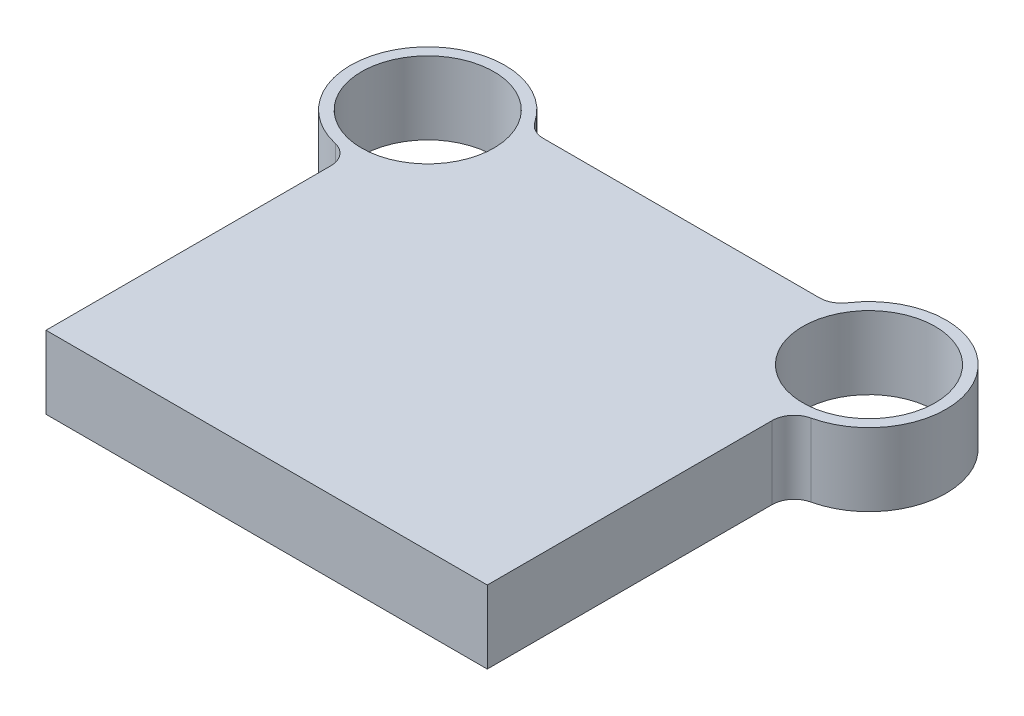
ISO-10303-21;
HEADER;
FILE_DESCRIPTION(('STEP AP214'),'2;1');
FILE_NAME('part.step','',(''),(''),'','','');
FILE_SCHEMA(('AUTOMOTIVE_DESIGN { 1 0 10303 214 1 1 1 1 }'));
ENDSEC;
DATA;
#1=APPLICATION_CONTEXT('core data for automotive mechanical design processes');
#2=APPLICATION_PROTOCOL_DEFINITION('international standard','automotive_design',2000,#1);
#3=PRODUCT_CONTEXT('',#1,'mechanical');
#4=PRODUCT('Part','Part','',(#3));
#5=PRODUCT_RELATED_PRODUCT_CATEGORY('part','',(#4));
#6=PRODUCT_DEFINITION_FORMATION('','',#4);
#7=PRODUCT_DEFINITION_CONTEXT('part definition',#1,'design');
#8=PRODUCT_DEFINITION('design','',#6,#7);
#9=PRODUCT_DEFINITION_SHAPE('','',#8);
#10=(LENGTH_UNIT() NAMED_UNIT(*) SI_UNIT(.MILLI.,.METRE.));
#11=(NAMED_UNIT(*) PLANE_ANGLE_UNIT() SI_UNIT($,.RADIAN.));
#12=(NAMED_UNIT(*) SI_UNIT($,.STERADIAN.) SOLID_ANGLE_UNIT());
#13=UNCERTAINTY_MEASURE_WITH_UNIT(LENGTH_MEASURE(1.E-05),#10,'distance_accuracy_value','');
#14=(GEOMETRIC_REPRESENTATION_CONTEXT(3) GLOBAL_UNCERTAINTY_ASSIGNED_CONTEXT((#13)) GLOBAL_UNIT_ASSIGNED_CONTEXT((#10,
#11,#12)) REPRESENTATION_CONTEXT('',''));
#15=CARTESIAN_POINT('',(0.,0.,0.));
#16=DIRECTION('',(0.,0.,1.));
#17=DIRECTION('',(1.,0.,0.));
#18=AXIS2_PLACEMENT_3D('',#15,#16,#17);
#19=CARTESIAN_POINT('',(-100.,33.,-173.));
#20=DIRECTION('',(0.,1.,0.));
#21=DIRECTION('',(0.,0.,1.));
#22=AXIS2_PLACEMENT_3D('',#19,#20,#21);
#23=PLANE('',#22);
#24=CARTESIAN_POINT('',(-100.,33.,-173.));
#25=DIRECTION('',(0.,1.,0.));
#26=DIRECTION('',(0.,0.,1.));
#27=AXIS2_PLACEMENT_3D('',#24,#25,#26);
#28=CIRCLE('',#27,30.);
#29=CARTESIAN_POINT('',(-100.,33.,-143.));
#30=VERTEX_POINT('',#29);
#31=EDGE_CURVE('E240',#30,#30,#28,.T.);
#32=ORIENTED_EDGE('',*,*,#31,.F.);
#33=EDGE_LOOP('',(#32));
#34=FACE_BOUND('',#33,.T.);
#35=CARTESIAN_POINT('',(-100.,33.,-173.));
#36=DIRECTION('',(0.,1.,0.));
#37=DIRECTION('',(0.,0.,1.));
#38=AXIS2_PLACEMENT_3D('',#35,#36,#37);
#39=CIRCLE('',#38,35.);
#40=CARTESIAN_POINT('',(-70.8982203250916,33.,-192.444444444444));
#41=VERTEX_POINT('',#40);
#42=CARTESIAN_POINT('',(-107.777777777778,33.,-138.875138493475));
#43=VERTEX_POINT('',#42);
#44=EDGE_CURVE('E133',#41,#43,#39,.T.);
#45=ORIENTED_EDGE('',*,*,#44,.T.);
#46=CARTESIAN_POINT('',(-110.,33.,-129.125178063039));
#47=DIRECTION('',(0.,1.,0.));
#48=DIRECTION('',(0.,0.,1.));
#49=AXIS2_PLACEMENT_3D('',#46,#47,#48);
#50=CIRCLE('',#49,10.);
#51=CARTESIAN_POINT('',(-100.,33.,-129.125178063039));
#52=VERTEX_POINT('',#51);
#53=EDGE_CURVE('E11',#43,#52,#50,.F.);
#54=ORIENTED_EDGE('',*,*,#53,.T.);
#55=DIRECTION('',(0.,0.,1.));
#56=VECTOR('',#55,1.);
#57=CARTESIAN_POINT('',(-100.,33.,0.));
#58=LINE('',#57,#56);
#59=CARTESIAN_POINT('',(-100.,33.,0.));
#60=VERTEX_POINT('',#59);
#61=EDGE_CURVE('E106',#52,#60,#58,.T.);
#62=ORIENTED_EDGE('',*,*,#61,.T.);
#63=DIRECTION('',(1.,0.,0.));
#64=VECTOR('',#63,1.);
#65=CARTESIAN_POINT('',(100.,33.,0.));
#66=LINE('',#65,#64);
#67=CARTESIAN_POINT('',(100.,33.,0.));
#68=VERTEX_POINT('',#67);
#69=EDGE_CURVE('E110',#60,#68,#66,.T.);
#70=ORIENTED_EDGE('',*,*,#69,.T.);
#71=DIRECTION('',(0.,0.,-1.));
#72=VECTOR('',#71,1.);
#73=CARTESIAN_POINT('',(100.,33.,0.));
#74=LINE('',#73,#72);
#75=CARTESIAN_POINT('',(100.,33.,-129.125178063039));
#76=VERTEX_POINT('',#75);
#77=EDGE_CURVE('E123',#68,#76,#74,.T.);
#78=ORIENTED_EDGE('',*,*,#77,.T.);
#79=CARTESIAN_POINT('',(110.,33.,-129.125178063039));
#80=DIRECTION('',(0.,1.,0.));
#81=DIRECTION('',(0.,0.,1.));
#82=AXIS2_PLACEMENT_3D('',#79,#80,#81);
#83=CIRCLE('',#82,10.);
#84=CARTESIAN_POINT('',(107.777777777778,33.,-138.875138493475));
#85=VERTEX_POINT('',#84);
#86=EDGE_CURVE('E155',#76,#85,#83,.F.);
#87=ORIENTED_EDGE('',*,*,#86,.T.);
#88=CARTESIAN_POINT('',(100.,33.,-173.));
#89=DIRECTION('',(0.,1.,0.));
#90=DIRECTION('',(0.,0.,-1.));
#91=AXIS2_PLACEMENT_3D('',#88,#89,#90);
#92=CIRCLE('',#91,35.);
#93=CARTESIAN_POINT('',(70.8982203250916,33.,-192.444444444444));
#94=VERTEX_POINT('',#93);
#95=EDGE_CURVE('E229',#85,#94,#92,.T.);
#96=ORIENTED_EDGE('',*,*,#95,.T.);
#97=CARTESIAN_POINT('',(62.5834261322606,33.,-198.));
#98=DIRECTION('',(0.,1.,0.));
#99=DIRECTION('',(0.,0.,1.));
#100=AXIS2_PLACEMENT_3D('',#97,#98,#99);
#101=CIRCLE('',#100,10.);
#102=CARTESIAN_POINT('',(62.5834261322606,33.,-188.));
#103=VERTEX_POINT('',#102);
#104=EDGE_CURVE('E159',#94,#103,#101,.F.);
#105=ORIENTED_EDGE('',*,*,#104,.T.);
#106=DIRECTION('',(-1.,0.,0.));
#107=VECTOR('',#106,1.);
#108=CARTESIAN_POINT('',(68.3772233983162,33.,-188.));
#109=LINE('',#108,#107);
#110=CARTESIAN_POINT('',(-62.5834261322606,33.,-188.));
#111=VERTEX_POINT('',#110);
#112=EDGE_CURVE('E226',#103,#111,#109,.T.);
#113=ORIENTED_EDGE('',*,*,#112,.T.);
#114=CARTESIAN_POINT('',(-62.5834261322606,33.,-198.));
#115=DIRECTION('',(0.,1.,0.));
#116=DIRECTION('',(0.,0.,1.));
#117=AXIS2_PLACEMENT_3D('',#114,#115,#116);
#118=CIRCLE('',#117,10.);
#119=EDGE_CURVE('E163',#111,#41,#118,.F.);
#120=ORIENTED_EDGE('',*,*,#119,.T.);
#121=EDGE_LOOP('',(#45,#54,#62,#70,#78,#87,#96,#105,#113,#120));
#122=FACE_BOUND('',#121,.T.);
#123=CARTESIAN_POINT('',(100.,33.,-173.));
#124=DIRECTION('',(0.,1.,0.));
#125=DIRECTION('',(0.,0.,-1.));
#126=AXIS2_PLACEMENT_3D('',#123,#124,#125);
#127=CIRCLE('',#126,30.);
#128=CARTESIAN_POINT('',(100.,33.,-203.));
#129=VERTEX_POINT('',#128);
#130=EDGE_CURVE('E257',#129,#129,#127,.T.);
#131=ORIENTED_EDGE('',*,*,#130,.F.);
#132=EDGE_LOOP('',(#131));
#133=FACE_BOUND('',#132,.T.);
#134=ADVANCED_FACE('F33',(#34,#122,#133),#23,.T.);
#135=CARTESIAN_POINT('',(-100.,0.,-173.));
#136=DIRECTION('',(0.,1.,0.));
#137=DIRECTION('',(0.,0.,1.));
#138=AXIS2_PLACEMENT_3D('',#135,#136,#137);
#139=PLANE('',#138);
#140=DIRECTION('',(0.,0.,1.));
#141=VECTOR('',#140,1.);
#142=CARTESIAN_POINT('',(-100.,0.,0.));
#143=LINE('',#142,#141);
#144=CARTESIAN_POINT('',(-100.,0.,-129.125178063039));
#145=VERTEX_POINT('',#144);
#146=CARTESIAN_POINT('',(-100.,0.,0.));
#147=VERTEX_POINT('',#146);
#148=EDGE_CURVE('E127',#145,#147,#143,.T.);
#149=ORIENTED_EDGE('',*,*,#148,.F.);
#150=CARTESIAN_POINT('',(-110.,0.,-129.125178063039));
#151=DIRECTION('',(0.,1.,0.));
#152=DIRECTION('',(0.,0.,1.));
#153=AXIS2_PLACEMENT_3D('',#150,#151,#152);
#154=CIRCLE('',#153,10.);
#155=CARTESIAN_POINT('',(-107.777777777778,0.,-138.875138493475));
#156=VERTEX_POINT('',#155);
#157=EDGE_CURVE('E41',#145,#156,#154,.T.);
#158=ORIENTED_EDGE('',*,*,#157,.T.);
#159=CARTESIAN_POINT('',(-100.,0.,-173.));
#160=DIRECTION('',(0.,1.,0.));
#161=DIRECTION('',(0.,0.,1.));
#162=AXIS2_PLACEMENT_3D('',#159,#160,#161);
#163=CIRCLE('',#162,35.);
#164=CARTESIAN_POINT('',(-70.8982203250916,0.,-192.444444444444));
#165=VERTEX_POINT('',#164);
#166=EDGE_CURVE('E114',#165,#156,#163,.T.);
#167=ORIENTED_EDGE('',*,*,#166,.F.);
#168=CARTESIAN_POINT('',(-62.5834261322606,0.,-198.));
#169=DIRECTION('',(0.,1.,0.));
#170=DIRECTION('',(0.,0.,1.));
#171=AXIS2_PLACEMENT_3D('',#168,#169,#170);
#172=CIRCLE('',#171,10.);
#173=CARTESIAN_POINT('',(-62.5834261322606,0.,-188.));
#174=VERTEX_POINT('',#173);
#175=EDGE_CURVE('E161',#165,#174,#172,.T.);
#176=ORIENTED_EDGE('',*,*,#175,.T.);
#177=DIRECTION('',(-1.,0.,0.));
#178=VECTOR('',#177,1.);
#179=CARTESIAN_POINT('',(68.3772233983162,0.,-188.));
#180=LINE('',#179,#178);
#181=CARTESIAN_POINT('',(62.5834261322606,0.,-188.));
#182=VERTEX_POINT('',#181);
#183=EDGE_CURVE('E173',#182,#174,#180,.T.);
#184=ORIENTED_EDGE('',*,*,#183,.F.);
#185=CARTESIAN_POINT('',(62.5834261322606,0.,-198.));
#186=DIRECTION('',(0.,1.,0.));
#187=DIRECTION('',(0.,0.,1.));
#188=AXIS2_PLACEMENT_3D('',#185,#186,#187);
#189=CIRCLE('',#188,10.);
#190=CARTESIAN_POINT('',(70.8982203250916,0.,-192.444444444444));
#191=VERTEX_POINT('',#190);
#192=EDGE_CURVE('E157',#182,#191,#189,.T.);
#193=ORIENTED_EDGE('',*,*,#192,.T.);
#194=CARTESIAN_POINT('',(100.,0.,-173.));
#195=DIRECTION('',(0.,1.,0.));
#196=DIRECTION('',(0.,0.,-1.));
#197=AXIS2_PLACEMENT_3D('',#194,#195,#196);
#198=CIRCLE('',#197,35.);
#199=CARTESIAN_POINT('',(107.777777777778,0.,-138.875138493475));
#200=VERTEX_POINT('',#199);
#201=EDGE_CURVE('E245',#200,#191,#198,.T.);
#202=ORIENTED_EDGE('',*,*,#201,.F.);
#203=CARTESIAN_POINT('',(110.,0.,-129.125178063039));
#204=DIRECTION('',(0.,1.,0.));
#205=DIRECTION('',(0.,0.,1.));
#206=AXIS2_PLACEMENT_3D('',#203,#204,#205);
#207=CIRCLE('',#206,10.);
#208=CARTESIAN_POINT('',(100.,0.,-129.125178063039));
#209=VERTEX_POINT('',#208);
#210=EDGE_CURVE('E153',#200,#209,#207,.T.);
#211=ORIENTED_EDGE('',*,*,#210,.T.);
#212=DIRECTION('',(0.,0.,-1.));
#213=VECTOR('',#212,1.);
#214=CARTESIAN_POINT('',(100.,0.,0.));
#215=LINE('',#214,#213);
#216=CARTESIAN_POINT('',(100.,0.,0.));
#217=VERTEX_POINT('',#216);
#218=EDGE_CURVE('E242',#217,#209,#215,.T.);
#219=ORIENTED_EDGE('',*,*,#218,.F.);
#220=DIRECTION('',(1.,0.,0.));
#221=VECTOR('',#220,1.);
#222=CARTESIAN_POINT('',(100.,0.,0.));
#223=LINE('',#222,#221);
#224=EDGE_CURVE('E239',#147,#217,#223,.T.);
#225=ORIENTED_EDGE('',*,*,#224,.F.);
#226=EDGE_LOOP('',(#149,#158,#167,#176,#184,#193,#202,#211,#219,#225));
#227=FACE_BOUND('',#226,.T.);
#228=CARTESIAN_POINT('',(-100.,0.,-173.));
#229=DIRECTION('',(0.,1.,0.));
#230=DIRECTION('',(0.,0.,1.));
#231=AXIS2_PLACEMENT_3D('',#228,#229,#230);
#232=CIRCLE('',#231,30.);
#233=CARTESIAN_POINT('',(-100.,0.,-143.));
#234=VERTEX_POINT('',#233);
#235=EDGE_CURVE('E254',#234,#234,#232,.T.);
#236=ORIENTED_EDGE('',*,*,#235,.T.);
#237=EDGE_LOOP('',(#236));
#238=FACE_BOUND('',#237,.T.);
#239=CARTESIAN_POINT('',(100.,0.,-173.));
#240=DIRECTION('',(0.,1.,0.));
#241=DIRECTION('',(0.,0.,-1.));
#242=AXIS2_PLACEMENT_3D('',#239,#240,#241);
#243=CIRCLE('',#242,30.);
#244=CARTESIAN_POINT('',(100.,0.,-203.));
#245=VERTEX_POINT('',#244);
#246=EDGE_CURVE('E260',#245,#245,#243,.T.);
#247=ORIENTED_EDGE('',*,*,#246,.T.);
#248=EDGE_LOOP('',(#247));
#249=FACE_BOUND('',#248,.T.);
#250=ADVANCED_FACE('F167',(#227,#238,#249),#139,.F.);
#251=CARTESIAN_POINT('',(-100.,33.,0.));
#252=DIRECTION('',(1.,0.,0.));
#253=DIRECTION('',(0.,0.,-1.));
#254=AXIS2_PLACEMENT_3D('',#251,#252,#253);
#255=PLANE('',#254);
#256=ORIENTED_EDGE('',*,*,#61,.F.);
#257=DIRECTION('',(0.,1.,0.));
#258=VECTOR('',#257,1.);
#259=CARTESIAN_POINT('',(-100.,0.,-129.125178063039));
#260=LINE('',#259,#258);
#261=EDGE_CURVE('E151',#52,#145,#260,.F.);
#262=ORIENTED_EDGE('',*,*,#261,.T.);
#263=ORIENTED_EDGE('',*,*,#148,.T.);
#264=DIRECTION('',(0.,-1.,0.));
#265=VECTOR('',#264,1.);
#266=CARTESIAN_POINT('',(-100.,33.,0.));
#267=LINE('',#266,#265);
#268=EDGE_CURVE('E119',#60,#147,#267,.T.);
#269=ORIENTED_EDGE('',*,*,#268,.F.);
#270=EDGE_LOOP('',(#256,#262,#263,#269));
#271=FACE_BOUND('',#270,.T.);
#272=ADVANCED_FACE('F125',(#271),#255,.F.);
#273=CARTESIAN_POINT('',(100.,33.,0.));
#274=DIRECTION('',(0.,0.,-1.));
#275=DIRECTION('',(-1.,0.,0.));
#276=AXIS2_PLACEMENT_3D('',#273,#274,#275);
#277=PLANE('',#276);
#278=ORIENTED_EDGE('',*,*,#224,.T.);
#279=DIRECTION('',(0.,-1.,0.));
#280=VECTOR('',#279,1.);
#281=CARTESIAN_POINT('',(100.,33.,0.));
#282=LINE('',#281,#280);
#283=EDGE_CURVE('E121',#68,#217,#282,.T.);
#284=ORIENTED_EDGE('',*,*,#283,.F.);
#285=ORIENTED_EDGE('',*,*,#69,.F.);
#286=ORIENTED_EDGE('',*,*,#268,.T.);
#287=EDGE_LOOP('',(#278,#284,#285,#286));
#288=FACE_BOUND('',#287,.T.);
#289=ADVANCED_FACE('F118',(#288),#277,.F.);
#290=CARTESIAN_POINT('',(100.,33.,0.));
#291=DIRECTION('',(-1.,0.,0.));
#292=DIRECTION('',(0.,0.,1.));
#293=AXIS2_PLACEMENT_3D('',#290,#291,#292);
#294=PLANE('',#293);
#295=ORIENTED_EDGE('',*,*,#218,.T.);
#296=DIRECTION('',(0.,1.,0.));
#297=VECTOR('',#296,1.);
#298=CARTESIAN_POINT('',(100.,33.,-129.125178063039));
#299=LINE('',#298,#297);
#300=EDGE_CURVE('E139',#209,#76,#299,.T.);
#301=ORIENTED_EDGE('',*,*,#300,.T.);
#302=ORIENTED_EDGE('',*,*,#77,.F.);
#303=ORIENTED_EDGE('',*,*,#283,.T.);
#304=EDGE_LOOP('',(#295,#301,#302,#303));
#305=FACE_BOUND('',#304,.T.);
#306=ADVANCED_FACE('F202',(#305),#294,.F.);
#307=CARTESIAN_POINT('',(100.,33.,-173.));
#308=DIRECTION('',(0.,-1.,0.));
#309=DIRECTION('',(0.,0.,-1.));
#310=AXIS2_PLACEMENT_3D('',#307,#308,#309);
#311=CYLINDRICAL_SURFACE('',#310,35.);
#312=ORIENTED_EDGE('',*,*,#95,.F.);
#313=DIRECTION('',(0.,-1.,0.));
#314=VECTOR('',#313,1.);
#315=CARTESIAN_POINT('',(107.777777777778,33.,-138.875138493475));
#316=LINE('',#315,#314);
#317=EDGE_CURVE('E131',#85,#200,#316,.T.);
#318=ORIENTED_EDGE('',*,*,#317,.T.);
#319=ORIENTED_EDGE('',*,*,#201,.T.);
#320=DIRECTION('',(0.,-1.,0.));
#321=VECTOR('',#320,1.);
#322=CARTESIAN_POINT('',(70.8982203250916,33.,-192.444444444444));
#323=LINE('',#322,#321);
#324=EDGE_CURVE('E129',#191,#94,#323,.F.);
#325=ORIENTED_EDGE('',*,*,#324,.T.);
#326=EDGE_LOOP('',(#312,#318,#319,#325));
#327=FACE_BOUND('',#326,.T.);
#328=ADVANCED_FACE('F198',(#327),#311,.T.);
#329=CARTESIAN_POINT('',(68.3772233983162,33.,-188.));
#330=DIRECTION('',(0.,0.,1.));
#331=DIRECTION('',(1.,0.,0.));
#332=AXIS2_PLACEMENT_3D('',#329,#330,#331);
#333=PLANE('',#332);
#334=ORIENTED_EDGE('',*,*,#112,.F.);
#335=DIRECTION('',(0.,1.,0.));
#336=VECTOR('',#335,1.);
#337=CARTESIAN_POINT('',(62.5834261322606,0.,-188.));
#338=LINE('',#337,#336);
#339=EDGE_CURVE('E143',#103,#182,#338,.F.);
#340=ORIENTED_EDGE('',*,*,#339,.T.);
#341=ORIENTED_EDGE('',*,*,#183,.T.);
#342=DIRECTION('',(0.,1.,0.));
#343=VECTOR('',#342,1.);
#344=CARTESIAN_POINT('',(-62.5834261322606,33.,-188.));
#345=LINE('',#344,#343);
#346=EDGE_CURVE('E141',#174,#111,#345,.T.);
#347=ORIENTED_EDGE('',*,*,#346,.T.);
#348=EDGE_LOOP('',(#334,#340,#341,#347));
#349=FACE_BOUND('',#348,.T.);
#350=ADVANCED_FACE('F195',(#349),#333,.F.);
#351=CARTESIAN_POINT('',(-100.,33.,-173.));
#352=DIRECTION('',(0.,-1.,0.));
#353=DIRECTION('',(0.,0.,-1.));
#354=AXIS2_PLACEMENT_3D('',#351,#352,#353);
#355=CYLINDRICAL_SURFACE('',#354,35.);
#356=ORIENTED_EDGE('',*,*,#44,.F.);
#357=DIRECTION('',(0.,-1.,0.));
#358=VECTOR('',#357,1.);
#359=CARTESIAN_POINT('',(-70.8982203250916,33.,-192.444444444444));
#360=LINE('',#359,#358);
#361=EDGE_CURVE('E148',#41,#165,#360,.T.);
#362=ORIENTED_EDGE('',*,*,#361,.T.);
#363=ORIENTED_EDGE('',*,*,#166,.T.);
#364=DIRECTION('',(0.,-1.,0.));
#365=VECTOR('',#364,1.);
#366=CARTESIAN_POINT('',(-107.777777777778,33.,-138.875138493475));
#367=LINE('',#366,#365);
#368=EDGE_CURVE('E146',#156,#43,#367,.F.);
#369=ORIENTED_EDGE('',*,*,#368,.T.);
#370=EDGE_LOOP('',(#356,#362,#363,#369));
#371=FACE_BOUND('',#370,.T.);
#372=ADVANCED_FACE('F171',(#371),#355,.T.);
#373=CARTESIAN_POINT('',(-100.,33.,-173.));
#374=DIRECTION('',(0.,-1.,0.));
#375=DIRECTION('',(0.,0.,-1.));
#376=AXIS2_PLACEMENT_3D('',#373,#374,#375);
#377=CYLINDRICAL_SURFACE('',#376,30.);
#378=ORIENTED_EDGE('',*,*,#31,.T.);
#379=EDGE_LOOP('',(#378));
#380=FACE_BOUND('',#379,.T.);
#381=ORIENTED_EDGE('',*,*,#235,.F.);
#382=EDGE_LOOP('',(#381));
#383=FACE_BOUND('',#382,.T.);
#384=ADVANCED_FACE('F190',(#380,#383),#377,.F.);
#385=CARTESIAN_POINT('',(100.,33.,-173.));
#386=DIRECTION('',(0.,-1.,0.));
#387=DIRECTION('',(0.,0.,-1.));
#388=AXIS2_PLACEMENT_3D('',#385,#386,#387);
#389=CYLINDRICAL_SURFACE('',#388,30.);
#390=ORIENTED_EDGE('',*,*,#130,.T.);
#391=EDGE_LOOP('',(#390));
#392=FACE_BOUND('',#391,.T.);
#393=ORIENTED_EDGE('',*,*,#246,.F.);
#394=EDGE_LOOP('',(#393));
#395=FACE_BOUND('',#394,.T.);
#396=ADVANCED_FACE('F214',(#392,#395),#389,.F.);
#397=CARTESIAN_POINT('',(110.,33.,-129.125178063039));
#398=DIRECTION('',(0.,-1.,0.));
#399=DIRECTION('',(0.,0.,-1.));
#400=AXIS2_PLACEMENT_3D('',#397,#398,#399);
#401=CYLINDRICAL_SURFACE('',#400,10.);
#402=ORIENTED_EDGE('',*,*,#86,.F.);
#403=ORIENTED_EDGE('',*,*,#300,.F.);
#404=ORIENTED_EDGE('',*,*,#210,.F.);
#405=ORIENTED_EDGE('',*,*,#317,.F.);
#406=EDGE_LOOP('',(#402,#403,#404,#405));
#407=FACE_BOUND('',#406,.T.);
#408=ADVANCED_FACE('F211',(#407),#401,.F.);
#409=CARTESIAN_POINT('',(62.5834261322606,33.,-198.));
#410=DIRECTION('',(0.,-1.,0.));
#411=DIRECTION('',(0.,0.,-1.));
#412=AXIS2_PLACEMENT_3D('',#409,#410,#411);
#413=CYLINDRICAL_SURFACE('',#412,10.);
#414=ORIENTED_EDGE('',*,*,#104,.F.);
#415=ORIENTED_EDGE('',*,*,#324,.F.);
#416=ORIENTED_EDGE('',*,*,#192,.F.);
#417=ORIENTED_EDGE('',*,*,#339,.F.);
#418=EDGE_LOOP('',(#414,#415,#416,#417));
#419=FACE_BOUND('',#418,.T.);
#420=ADVANCED_FACE('F179',(#419),#413,.F.);
#421=CARTESIAN_POINT('',(-62.5834261322606,33.,-198.));
#422=DIRECTION('',(0.,-1.,0.));
#423=DIRECTION('',(0.,0.,-1.));
#424=AXIS2_PLACEMENT_3D('',#421,#422,#423);
#425=CYLINDRICAL_SURFACE('',#424,10.);
#426=ORIENTED_EDGE('',*,*,#119,.F.);
#427=ORIENTED_EDGE('',*,*,#346,.F.);
#428=ORIENTED_EDGE('',*,*,#175,.F.);
#429=ORIENTED_EDGE('',*,*,#361,.F.);
#430=EDGE_LOOP('',(#426,#427,#428,#429));
#431=FACE_BOUND('',#430,.T.);
#432=ADVANCED_FACE('F175',(#431),#425,.F.);
#433=CARTESIAN_POINT('',(-110.,33.,-129.125178063039));
#434=DIRECTION('',(0.,-1.,0.));
#435=DIRECTION('',(0.,0.,-1.));
#436=AXIS2_PLACEMENT_3D('',#433,#434,#435);
#437=CYLINDRICAL_SURFACE('',#436,10.);
#438=ORIENTED_EDGE('',*,*,#53,.F.);
#439=ORIENTED_EDGE('',*,*,#368,.F.);
#440=ORIENTED_EDGE('',*,*,#157,.F.);
#441=ORIENTED_EDGE('',*,*,#261,.F.);
#442=EDGE_LOOP('',(#438,#439,#440,#441));
#443=FACE_BOUND('',#442,.T.);
#444=ADVANCED_FACE('F35',(#443),#437,.F.);
#445=CLOSED_SHELL('',(#134,#250,#272,#289,#306,#328,#350,#372,#384,#396,#408,#420,#432,#444));
#446=MANIFOLD_SOLID_BREP('B2',#445);
#447=ADVANCED_BREP_SHAPE_REPRESENTATION('',(#18,#446),#14);
#448=SHAPE_DEFINITION_REPRESENTATION(#9,#447);
ENDSEC;
END-ISO-10303-21;
